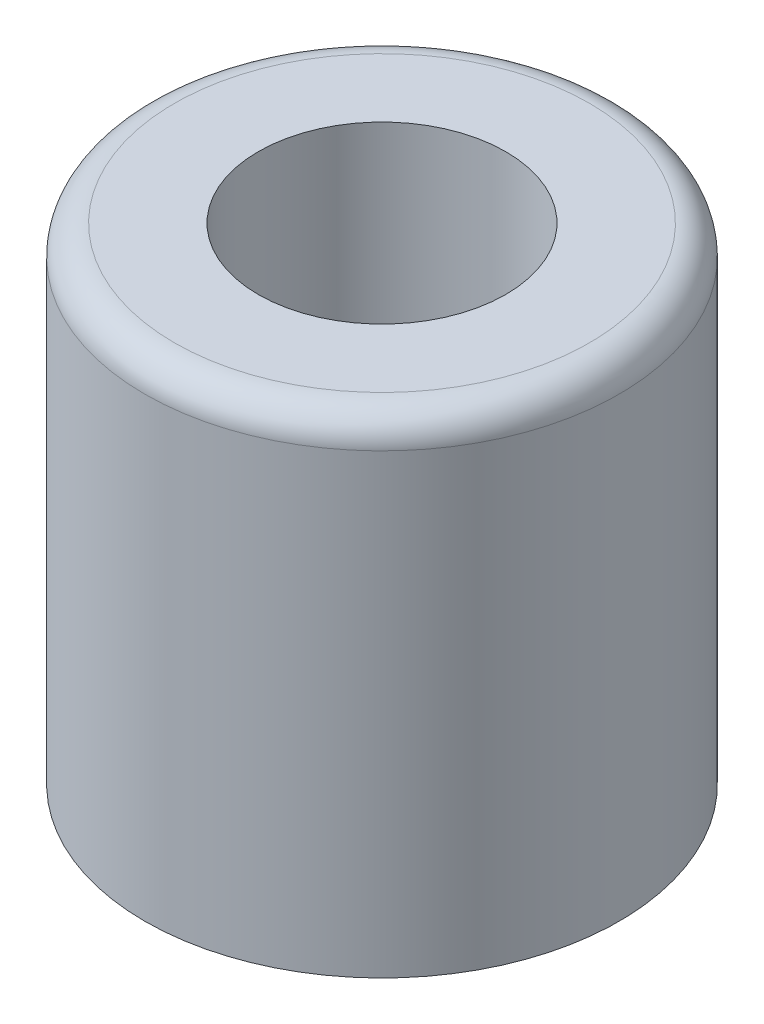
ISO-10303-21;
HEADER;
FILE_DESCRIPTION(('STEP AP214'),'2;1');
FILE_NAME('part.step','',(''),(''),'','','');
FILE_SCHEMA(('AUTOMOTIVE_DESIGN { 1 0 10303 214 1 1 1 1 }'));
ENDSEC;
DATA;
#1=APPLICATION_CONTEXT('core data for automotive mechanical design processes');
#2=APPLICATION_PROTOCOL_DEFINITION('international standard','automotive_design',2000,#1);
#3=PRODUCT_CONTEXT('',#1,'mechanical');
#4=PRODUCT('Part','Part','',(#3));
#5=PRODUCT_RELATED_PRODUCT_CATEGORY('part','',(#4));
#6=PRODUCT_DEFINITION_FORMATION('','',#4);
#7=PRODUCT_DEFINITION_CONTEXT('part definition',#1,'design');
#8=PRODUCT_DEFINITION('design','',#6,#7);
#9=PRODUCT_DEFINITION_SHAPE('','',#8);
#10=(LENGTH_UNIT() NAMED_UNIT(*) SI_UNIT(.MILLI.,.METRE.));
#11=(NAMED_UNIT(*) PLANE_ANGLE_UNIT() SI_UNIT($,.RADIAN.));
#12=(NAMED_UNIT(*) SI_UNIT($,.STERADIAN.) SOLID_ANGLE_UNIT());
#13=UNCERTAINTY_MEASURE_WITH_UNIT(LENGTH_MEASURE(1.E-05),#10,'distance_accuracy_value','');
#14=(GEOMETRIC_REPRESENTATION_CONTEXT(3) GLOBAL_UNCERTAINTY_ASSIGNED_CONTEXT((#13)) GLOBAL_UNIT_ASSIGNED_CONTEXT((#10,
#11,#12)) REPRESENTATION_CONTEXT('',''));
#15=CARTESIAN_POINT('',(0.,0.,0.));
#16=DIRECTION('',(0.,0.,1.));
#17=DIRECTION('',(1.,0.,0.));
#18=AXIS2_PLACEMENT_3D('',#15,#16,#17);
#19=CARTESIAN_POINT('',(0.,4.1656,0.));
#20=DIRECTION('',(0.,1.,0.));
#21=DIRECTION('',(0.,0.,1.));
#22=AXIS2_PLACEMENT_3D('',#19,#20,#21);
#23=PLANE('',#22);
#24=CARTESIAN_POINT('',(0.,4.1656,0.));
#25=DIRECTION('',(0.,-1.,0.));
#26=DIRECTION('',(0.,0.,-1.));
#27=AXIS2_PLACEMENT_3D('',#24,#25,#26);
#28=CIRCLE('',#27,2.1209);
#29=CARTESIAN_POINT('',(0.,4.1656,-2.1209));
#30=VERTEX_POINT('',#29);
#31=EDGE_CURVE('E38',#30,#30,#28,.T.);
#32=ORIENTED_EDGE('',*,*,#31,.T.);
#33=EDGE_LOOP('',(#32));
#34=FACE_BOUND('',#33,.T.);
#35=CARTESIAN_POINT('',(0.,4.1656,0.));
#36=DIRECTION('',(0.,-1.,0.));
#37=DIRECTION('',(0.,0.,-1.));
#38=AXIS2_PLACEMENT_3D('',#35,#36,#37);
#39=CIRCLE('',#38,3.556);
#40=CARTESIAN_POINT('',(0.,4.1656,-3.556));
#41=VERTEX_POINT('',#40);
#42=CARTESIAN_POINT('',(0.,4.1656,3.556));
#43=VERTEX_POINT('',#42);
#44=EDGE_CURVE('E32',#41,#43,#39,.T.);
#45=ORIENTED_EDGE('',*,*,#44,.F.);
#46=CARTESIAN_POINT('',(0.,4.1656,0.));
#47=DIRECTION('',(0.,-1.,0.));
#48=DIRECTION('',(0.,0.,1.));
#49=AXIS2_PLACEMENT_3D('',#46,#47,#48);
#50=CIRCLE('',#49,3.556);
#51=EDGE_CURVE('E36',#43,#41,#50,.T.);
#52=ORIENTED_EDGE('',*,*,#51,.F.);
#53=EDGE_LOOP('',(#45,#52));
#54=FACE_BOUND('',#53,.T.);
#55=ADVANCED_FACE('F14',(#34,#54),#23,.T.);
#56=CARTESIAN_POINT('',(0.,4.1656,0.));
#57=DIRECTION('',(0.,-1.,0.));
#58=DIRECTION('',(0.,0.,-1.));
#59=AXIS2_PLACEMENT_3D('',#56,#57,#58);
#60=CYLINDRICAL_SURFACE('',#59,2.1209);
#61=CARTESIAN_POINT('',(0.,-4.1656,0.));
#62=DIRECTION('',(0.,-1.,0.));
#63=DIRECTION('',(0.,0.,-1.));
#64=AXIS2_PLACEMENT_3D('',#61,#62,#63);
#65=CIRCLE('',#64,2.1209);
#66=CARTESIAN_POINT('',(0.,-4.1656,-2.1209));
#67=VERTEX_POINT('',#66);
#68=EDGE_CURVE('E42',#67,#67,#65,.T.);
#69=ORIENTED_EDGE('',*,*,#68,.T.);
#70=EDGE_LOOP('',(#69));
#71=FACE_BOUND('',#70,.T.);
#72=ORIENTED_EDGE('',*,*,#31,.F.);
#73=EDGE_LOOP('',(#72));
#74=FACE_BOUND('',#73,.T.);
#75=ADVANCED_FACE('F58',(#71,#74),#60,.F.);
#76=CARTESIAN_POINT('',(0.,3.6576,0.));
#77=DIRECTION('',(0.,1.,0.));
#78=DIRECTION('',(0.,0.,1.));
#79=AXIS2_PLACEMENT_3D('',#76,#77,#78);
#80=TOROIDAL_SURFACE('',#79,3.556,0.508);
#81=CARTESIAN_POINT('',(0.,3.6576,0.));
#82=DIRECTION('',(0.,-1.,0.));
#83=DIRECTION('',(0.,0.,-1.));
#84=AXIS2_PLACEMENT_3D('',#81,#82,#83);
#85=CIRCLE('',#84,4.064);
#86=CARTESIAN_POINT('',(0.,3.6576,-4.064));
#87=VERTEX_POINT('',#86);
#88=EDGE_CURVE('E26',#87,#87,#85,.T.);
#89=ORIENTED_EDGE('',*,*,#88,.F.);
#90=EDGE_LOOP('',(#89));
#91=FACE_BOUND('',#90,.T.);
#92=ORIENTED_EDGE('',*,*,#51,.T.);
#93=ORIENTED_EDGE('',*,*,#44,.T.);
#94=EDGE_LOOP('',(#92,#93));
#95=FACE_BOUND('',#94,.T.);
#96=ADVANCED_FACE('F41',(#91,#95),#80,.T.);
#97=CARTESIAN_POINT('',(0.,-4.1656,0.));
#98=DIRECTION('',(0.,1.,0.));
#99=DIRECTION('',(0.,0.,1.));
#100=AXIS2_PLACEMENT_3D('',#97,#98,#99);
#101=PLANE('',#100);
#102=ORIENTED_EDGE('',*,*,#68,.F.);
#103=EDGE_LOOP('',(#102));
#104=FACE_BOUND('',#103,.T.);
#105=CARTESIAN_POINT('',(0.,-4.1656,0.));
#106=DIRECTION('',(0.,-1.,0.));
#107=DIRECTION('',(0.,0.,-1.));
#108=AXIS2_PLACEMENT_3D('',#105,#106,#107);
#109=CIRCLE('',#108,4.064);
#110=CARTESIAN_POINT('',(0.,-4.1656,-4.064));
#111=VERTEX_POINT('',#110);
#112=EDGE_CURVE('E9',#111,#111,#109,.F.);
#113=ORIENTED_EDGE('',*,*,#112,.F.);
#114=EDGE_LOOP('',(#113));
#115=FACE_BOUND('',#114,.T.);
#116=ADVANCED_FACE('F57',(#104,#115),#101,.F.);
#117=CARTESIAN_POINT('',(0.,4.1656,0.));
#118=DIRECTION('',(0.,-1.,0.));
#119=DIRECTION('',(0.,0.,-1.));
#120=AXIS2_PLACEMENT_3D('',#117,#118,#119);
#121=CYLINDRICAL_SURFACE('',#120,4.064);
#122=ORIENTED_EDGE('',*,*,#88,.T.);
#123=EDGE_LOOP('',(#122));
#124=FACE_BOUND('',#123,.T.);
#125=ORIENTED_EDGE('',*,*,#112,.T.);
#126=EDGE_LOOP('',(#125));
#127=FACE_BOUND('',#126,.T.);
#128=ADVANCED_FACE('F16',(#124,#127),#121,.T.);
#129=CLOSED_SHELL('',(#55,#75,#96,#116,#128));
#130=MANIFOLD_SOLID_BREP('B1',#129);
#131=ADVANCED_BREP_SHAPE_REPRESENTATION('',(#18,#130),#14);
#132=SHAPE_DEFINITION_REPRESENTATION(#9,#131);
ENDSEC;
END-ISO-10303-21;
